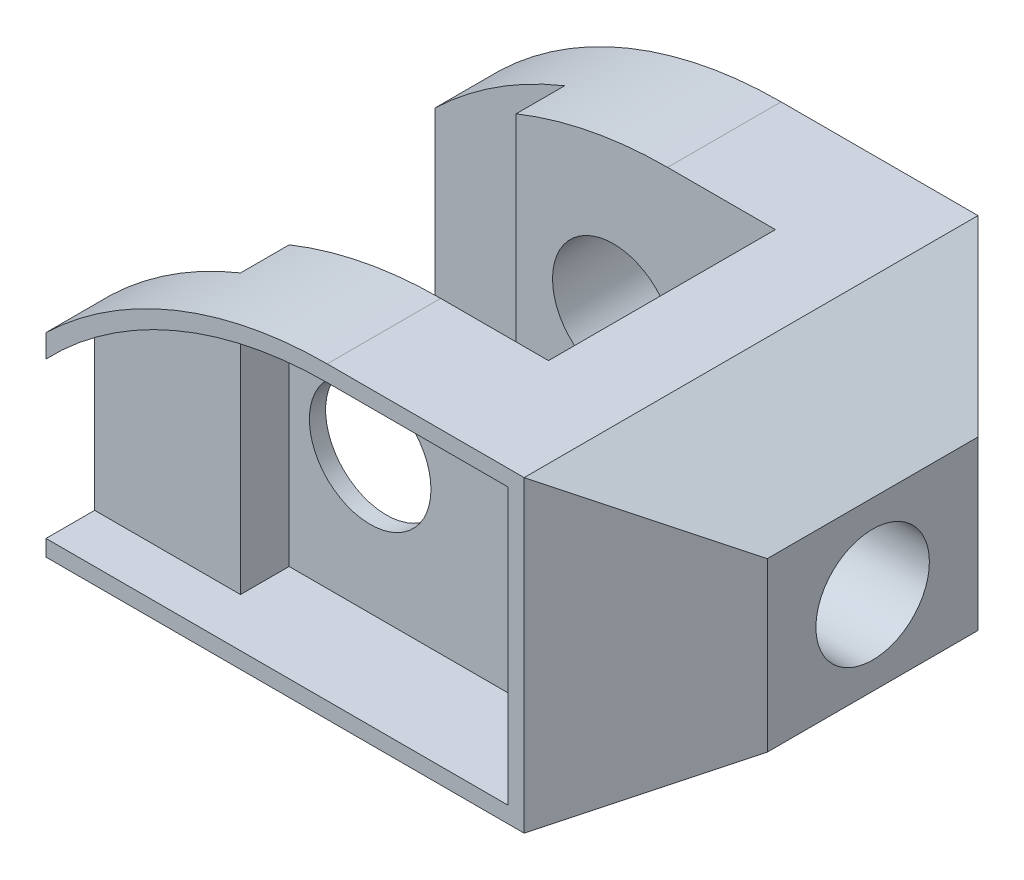
ISO-10303-21;
HEADER;
FILE_DESCRIPTION(('STEP AP214'),'2;1');
FILE_NAME('part.step','',(''),(''),'','','');
FILE_SCHEMA(('AUTOMOTIVE_DESIGN { 1 0 10303 214 1 1 1 1 }'));
ENDSEC;
DATA;
#1=APPLICATION_CONTEXT('core data for automotive mechanical design processes');
#2=APPLICATION_PROTOCOL_DEFINITION('international standard','automotive_design',2000,#1);
#3=PRODUCT_CONTEXT('',#1,'mechanical');
#4=PRODUCT('Part','Part','',(#3));
#5=PRODUCT_RELATED_PRODUCT_CATEGORY('part','',(#4));
#6=PRODUCT_DEFINITION_FORMATION('','',#4);
#7=PRODUCT_DEFINITION_CONTEXT('part definition',#1,'design');
#8=PRODUCT_DEFINITION('design','',#6,#7);
#9=PRODUCT_DEFINITION_SHAPE('','',#8);
#10=(LENGTH_UNIT() NAMED_UNIT(*) SI_UNIT(.MILLI.,.METRE.));
#11=(NAMED_UNIT(*) PLANE_ANGLE_UNIT() SI_UNIT($,.RADIAN.));
#12=(NAMED_UNIT(*) SI_UNIT($,.STERADIAN.) SOLID_ANGLE_UNIT());
#13=UNCERTAINTY_MEASURE_WITH_UNIT(LENGTH_MEASURE(1.E-05),#10,'distance_accuracy_value','');
#14=(GEOMETRIC_REPRESENTATION_CONTEXT(3) GLOBAL_UNCERTAINTY_ASSIGNED_CONTEXT((#13)) GLOBAL_UNIT_ASSIGNED_CONTEXT((#10,
#11,#12)) REPRESENTATION_CONTEXT('',''));
#15=CARTESIAN_POINT('',(0.,0.,0.));
#16=DIRECTION('',(0.,0.,1.));
#17=DIRECTION('',(1.,0.,0.));
#18=AXIS2_PLACEMENT_3D('',#15,#16,#17);
#19=CARTESIAN_POINT('',(0.,0.,56.));
#20=DIRECTION('',(0.,0.,-1.));
#21=DIRECTION('',(-1.,0.,0.));
#22=AXIS2_PLACEMENT_3D('',#19,#20,#21);
#23=CYLINDRICAL_SURFACE('',#22,7.5);
#24=CARTESIAN_POINT('',(0.,0.,42.));
#25=DIRECTION('',(0.,0.,1.));
#26=DIRECTION('',(1.,0.,0.));
#27=AXIS2_PLACEMENT_3D('',#24,#25,#26);
#28=CIRCLE('',#27,7.5);
#29=CARTESIAN_POINT('',(7.5,0.,42.));
#30=VERTEX_POINT('',#29);
#31=EDGE_CURVE('E302',#30,#30,#28,.T.);
#32=ORIENTED_EDGE('',*,*,#31,.F.);
#33=EDGE_LOOP('',(#32));
#34=FACE_BOUND('',#33,.T.);
#35=CARTESIAN_POINT('',(0.,0.,44.));
#36=DIRECTION('',(0.,0.,1.));
#37=DIRECTION('',(1.,0.,0.));
#38=AXIS2_PLACEMENT_3D('',#35,#36,#37);
#39=CIRCLE('',#38,7.5);
#40=CARTESIAN_POINT('',(7.5,0.,44.));
#41=VERTEX_POINT('',#40);
#42=EDGE_CURVE('E47',#41,#41,#39,.T.);
#43=ORIENTED_EDGE('',*,*,#42,.T.);
#44=EDGE_LOOP('',(#43));
#45=FACE_BOUND('',#44,.T.);
#46=ADVANCED_FACE('F43',(#34,#45),#23,.F.);
#47=CARTESIAN_POINT('',(-28.,-19.,56.));
#48=DIRECTION('',(1.,0.,0.));
#49=DIRECTION('',(0.,0.,-1.));
#50=AXIS2_PLACEMENT_3D('',#47,#48,#49);
#51=PLANE('',#50);
#52=DIRECTION('',(0.,0.,-1.));
#53=VECTOR('',#52,1.);
#54=CARTESIAN_POINT('',(-28.,-19.,56.));
#55=LINE('',#54,#53);
#56=CARTESIAN_POINT('',(-28.,-19.,8.));
#57=VERTEX_POINT('',#56);
#58=CARTESIAN_POINT('',(-28.,-19.,0.));
#59=VERTEX_POINT('',#58);
#60=EDGE_CURVE('E363',#57,#59,#55,.T.);
#61=ORIENTED_EDGE('',*,*,#60,.F.);
#62=DIRECTION('',(0.,1.,0.));
#63=VECTOR('',#62,1.);
#64=CARTESIAN_POINT('',(-28.,-81.4819974072532,8.));
#65=LINE('',#64,#63);
#66=CARTESIAN_POINT('',(-28.,5.,8.));
#67=VERTEX_POINT('',#66);
#68=EDGE_CURVE('E280',#57,#67,#65,.T.);
#69=ORIENTED_EDGE('',*,*,#68,.T.);
#70=DIRECTION('',(0.,0.,-1.));
#71=VECTOR('',#70,1.);
#72=CARTESIAN_POINT('',(-28.,4.99999999999999,56.));
#73=LINE('',#72,#71);
#74=CARTESIAN_POINT('',(-28.,4.99999999999999,0.));
#75=VERTEX_POINT('',#74);
#76=EDGE_CURVE('E332',#67,#75,#73,.T.);
#77=ORIENTED_EDGE('',*,*,#76,.T.);
#78=DIRECTION('',(0.,-1.,0.));
#79=VECTOR('',#78,1.);
#80=CARTESIAN_POINT('',(-28.,-19.,0.));
#81=LINE('',#80,#79);
#82=EDGE_CURVE('E320',#75,#59,#81,.T.);
#83=ORIENTED_EDGE('',*,*,#82,.T.);
#84=EDGE_LOOP('',(#61,#69,#77,#83));
#85=FACE_BOUND('',#84,.T.);
#86=ADVANCED_FACE('F465',(#85),#51,.F.);
#87=CARTESIAN_POINT('',(6.69870314579494,-31.,56.));
#88=DIRECTION('',(0.,0.,-1.));
#89=DIRECTION('',(-1.,0.,0.));
#90=AXIS2_PLACEMENT_3D('',#87,#88,#89);
#91=CYLINDRICAL_SURFACE('',#90,50.);
#92=ORIENTED_EDGE('',*,*,#76,.F.);
#93=CARTESIAN_POINT('',(6.69870314579494,-31.,8.));
#94=DIRECTION('',(0.,0.,-1.));
#95=DIRECTION('',(-1.,0.,0.));
#96=AXIS2_PLACEMENT_3D('',#93,#94,#95);
#97=CIRCLE('',#96,50.);
#98=CARTESIAN_POINT('',(-12.,15.3719581284362,8.));
#99=VERTEX_POINT('',#98);
#100=EDGE_CURVE('E380',#67,#99,#97,.T.);
#101=ORIENTED_EDGE('',*,*,#100,.T.);
#102=DIRECTION('',(0.,0.,-1.));
#103=VECTOR('',#102,1.);
#104=CARTESIAN_POINT('',(-12.,15.3719581284362,56.));
#105=LINE('',#104,#103);
#106=CARTESIAN_POINT('',(-12.,15.3719581284362,14.));
#107=VERTEX_POINT('',#106);
#108=EDGE_CURVE('E377',#99,#107,#105,.F.);
#109=ORIENTED_EDGE('',*,*,#108,.T.);
#110=CARTESIAN_POINT('',(6.69870314579494,-31.,14.));
#111=DIRECTION('',(0.,0.,-1.));
#112=DIRECTION('',(-1.,0.,0.));
#113=AXIS2_PLACEMENT_3D('',#110,#111,#112);
#114=CIRCLE('',#113,50.);
#115=CARTESIAN_POINT('',(6.69870314579496,19.,14.));
#116=VERTEX_POINT('',#115);
#117=EDGE_CURVE('E308',#107,#116,#114,.T.);
#118=ORIENTED_EDGE('',*,*,#117,.T.);
#119=DIRECTION('',(0.,0.,-1.));
#120=VECTOR('',#119,1.);
#121=CARTESIAN_POINT('',(6.69870314579495,19.,56.));
#122=LINE('',#121,#120);
#123=CARTESIAN_POINT('',(6.69870314579495,19.,0.));
#124=VERTEX_POINT('',#123);
#125=EDGE_CURVE('E347',#116,#124,#122,.T.);
#126=ORIENTED_EDGE('',*,*,#125,.T.);
#127=CARTESIAN_POINT('',(6.69870314579494,-31.,0.));
#128=DIRECTION('',(0.,0.,1.));
#129=DIRECTION('',(1.,0.,0.));
#130=AXIS2_PLACEMENT_3D('',#127,#128,#129);
#131=CIRCLE('',#130,50.);
#132=EDGE_CURVE('E341',#124,#75,#131,.T.);
#133=ORIENTED_EDGE('',*,*,#132,.T.);
#134=EDGE_LOOP('',(#92,#101,#109,#118,#126,#133));
#135=FACE_BOUND('',#134,.T.);
#136=ADVANCED_FACE('F404',(#135),#91,.T.);
#137=CARTESIAN_POINT('',(0.,0.,14.));
#138=DIRECTION('',(0.,0.,-1.));
#139=DIRECTION('',(-1.,0.,0.));
#140=AXIS2_PLACEMENT_3D('',#137,#138,#139);
#141=CIRCLE('',#140,7.5);
#142=CARTESIAN_POINT('',(-7.5,0.,14.));
#143=VERTEX_POINT('',#142);
#144=EDGE_CURVE('E307',#143,#143,#141,.T.);
#145=ORIENTED_EDGE('',*,*,#144,.F.);
#146=EDGE_LOOP('',(#145));
#147=FACE_BOUND('',#146,.T.);
#148=CARTESIAN_POINT('',(0.,0.,0.));
#149=DIRECTION('',(0.,0.,1.));
#150=DIRECTION('',(1.,0.,0.));
#151=AXIS2_PLACEMENT_3D('',#148,#149,#150);
#152=CIRCLE('',#151,7.5);
#153=CARTESIAN_POINT('',(7.5,0.,0.));
#154=VERTEX_POINT('',#153);
#155=EDGE_CURVE('E317',#154,#154,#152,.T.);
#156=ORIENTED_EDGE('',*,*,#155,.F.);
#157=EDGE_LOOP('',(#156));
#158=FACE_BOUND('',#157,.T.);
#159=ADVANCED_FACE('F467',(#147,#158),#23,.F.);
#160=CARTESIAN_POINT('',(6.69870314579494,-31.,56.));
#161=DIRECTION('',(0.,0.,1.));
#162=DIRECTION('',(1.,0.,0.));
#163=AXIS2_PLACEMENT_3D('',#160,#161,#162);
#164=PLANE('',#163);
#165=CARTESIAN_POINT('',(6.69870314579495,-31.,56.));
#166=DIRECTION('',(0.,0.,1.));
#167=DIRECTION('',(1.,0.,0.));
#168=AXIS2_PLACEMENT_3D('',#165,#166,#167);
#169=CIRCLE('',#168,48.);
#170=CARTESIAN_POINT('',(6.69870314579495,17.,56.));
#171=VERTEX_POINT('',#170);
#172=CARTESIAN_POINT('',(-28.,2.16624790355399,56.));
#173=VERTEX_POINT('',#172);
#174=EDGE_CURVE('E227',#171,#173,#169,.T.);
#175=ORIENTED_EDGE('',*,*,#174,.F.);
#176=DIRECTION('',(-1.,0.,0.));
#177=VECTOR('',#176,1.);
#178=CARTESIAN_POINT('',(29.,17.,56.));
#179=LINE('',#178,#177);
#180=CARTESIAN_POINT('',(29.,17.,56.));
#181=VERTEX_POINT('',#180);
#182=EDGE_CURVE('E235',#181,#171,#179,.T.);
#183=ORIENTED_EDGE('',*,*,#182,.F.);
#184=DIRECTION('',(0.,1.,0.));
#185=VECTOR('',#184,1.);
#186=CARTESIAN_POINT('',(29.,-17.,56.));
#187=LINE('',#186,#185);
#188=CARTESIAN_POINT('',(29.,-17.,56.));
#189=VERTEX_POINT('',#188);
#190=EDGE_CURVE('E232',#189,#181,#187,.T.);
#191=ORIENTED_EDGE('',*,*,#190,.F.);
#192=DIRECTION('',(1.,0.,0.));
#193=VECTOR('',#192,1.);
#194=CARTESIAN_POINT('',(-28.,-17.,56.));
#195=LINE('',#194,#193);
#196=CARTESIAN_POINT('',(-28.,-17.,56.));
#197=VERTEX_POINT('',#196);
#198=EDGE_CURVE('E229',#197,#189,#195,.T.);
#199=ORIENTED_EDGE('',*,*,#198,.F.);
#200=DIRECTION('',(0.,-1.,0.));
#201=VECTOR('',#200,1.);
#202=CARTESIAN_POINT('',(-28.,-19.,56.));
#203=LINE('',#202,#201);
#204=CARTESIAN_POINT('',(-28.,-19.,56.));
#205=VERTEX_POINT('',#204);
#206=EDGE_CURVE('E325',#197,#205,#203,.T.);
#207=ORIENTED_EDGE('',*,*,#206,.T.);
#208=DIRECTION('',(1.,0.,0.));
#209=VECTOR('',#208,1.);
#210=CARTESIAN_POINT('',(-28.,-19.,56.));
#211=LINE('',#210,#209);
#212=CARTESIAN_POINT('',(31.,-19.,56.));
#213=VERTEX_POINT('',#212);
#214=EDGE_CURVE('E324',#205,#213,#211,.T.);
#215=ORIENTED_EDGE('',*,*,#214,.T.);
#216=DIRECTION('',(0.,1.,0.));
#217=VECTOR('',#216,1.);
#218=CARTESIAN_POINT('',(31.,-81.4819974072532,56.));
#219=LINE('',#218,#217);
#220=CARTESIAN_POINT('',(31.,19.,56.));
#221=VERTEX_POINT('',#220);
#222=EDGE_CURVE('E254',#213,#221,#219,.T.);
#223=ORIENTED_EDGE('',*,*,#222,.T.);
#224=DIRECTION('',(-1.,0.,0.));
#225=VECTOR('',#224,1.);
#226=CARTESIAN_POINT('',(6.69870314579495,19.,56.));
#227=LINE('',#226,#225);
#228=CARTESIAN_POINT('',(6.69870314579495,19.,56.));
#229=VERTEX_POINT('',#228);
#230=EDGE_CURVE('E328',#221,#229,#227,.T.);
#231=ORIENTED_EDGE('',*,*,#230,.T.);
#232=CARTESIAN_POINT('',(6.69870314579494,-31.,56.));
#233=DIRECTION('',(0.,0.,1.));
#234=DIRECTION('',(1.,0.,0.));
#235=AXIS2_PLACEMENT_3D('',#232,#233,#234);
#236=CIRCLE('',#235,50.);
#237=CARTESIAN_POINT('',(-28.,4.99999999999999,56.));
#238=VERTEX_POINT('',#237);
#239=EDGE_CURVE('E330',#229,#238,#236,.T.);
#240=ORIENTED_EDGE('',*,*,#239,.T.);
#241=EDGE_CURVE('E321',#238,#173,#203,.T.);
#242=ORIENTED_EDGE('',*,*,#241,.T.);
#243=EDGE_LOOP('',(#175,#183,#191,#199,#207,#215,#223,#231,#240,#242));
#244=FACE_BOUND('',#243,.T.);
#245=ADVANCED_FACE('F441',(#244),#164,.T.);
#246=CARTESIAN_POINT('',(6.69870314579494,-31.,0.));
#247=DIRECTION('',(0.,0.,1.));
#248=DIRECTION('',(1.,0.,0.));
#249=AXIS2_PLACEMENT_3D('',#246,#247,#248);
#250=PLANE('',#249);
#251=DIRECTION('',(-1.,0.,0.));
#252=VECTOR('',#251,1.);
#253=CARTESIAN_POINT('',(6.69870314579495,19.,0.));
#254=LINE('',#253,#252);
#255=CARTESIAN_POINT('',(31.,19.,0.));
#256=VERTEX_POINT('',#255);
#257=EDGE_CURVE('E338',#256,#124,#254,.T.);
#258=ORIENTED_EDGE('',*,*,#257,.F.);
#259=DIRECTION('',(0.,1.,0.));
#260=VECTOR('',#259,1.);
#261=CARTESIAN_POINT('',(31.,-81.4819974072532,0.));
#262=LINE('',#261,#260);
#263=CARTESIAN_POINT('',(31.,-19.,0.));
#264=VERTEX_POINT('',#263);
#265=EDGE_CURVE('E253',#264,#256,#262,.T.);
#266=ORIENTED_EDGE('',*,*,#265,.F.);
#267=DIRECTION('',(1.,0.,0.));
#268=VECTOR('',#267,1.);
#269=CARTESIAN_POINT('',(-28.,-19.,0.));
#270=LINE('',#269,#268);
#271=EDGE_CURVE('E335',#59,#264,#270,.T.);
#272=ORIENTED_EDGE('',*,*,#271,.F.);
#273=ORIENTED_EDGE('',*,*,#82,.F.);
#274=ORIENTED_EDGE('',*,*,#132,.F.);
#275=EDGE_LOOP('',(#258,#266,#272,#273,#274));
#276=FACE_BOUND('',#275,.T.);
#277=ORIENTED_EDGE('',*,*,#155,.T.);
#278=EDGE_LOOP('',(#277));
#279=FACE_BOUND('',#278,.T.);
#280=ADVANCED_FACE('F398',(#276,#279),#250,.F.);
#281=DIRECTION('',(0.,1.,0.));
#282=VECTOR('',#281,1.);
#283=CARTESIAN_POINT('',(-28.,2.16624790355399,50.));
#284=LINE('',#283,#282);
#285=CARTESIAN_POINT('',(-28.,-17.,50.));
#286=VERTEX_POINT('',#285);
#287=CARTESIAN_POINT('',(-28.,2.166247903554,50.));
#288=VERTEX_POINT('',#287);
#289=EDGE_CURVE('E219',#286,#288,#284,.T.);
#290=ORIENTED_EDGE('',*,*,#289,.T.);
#291=DIRECTION('',(0.,0.,1.));
#292=VECTOR('',#291,1.);
#293=CARTESIAN_POINT('',(-28.,2.16624790355399,-18.3701740241805));
#294=LINE('',#293,#292);
#295=EDGE_CURVE('E59',#288,#173,#294,.T.);
#296=ORIENTED_EDGE('',*,*,#295,.T.);
#297=ORIENTED_EDGE('',*,*,#241,.F.);
#298=CARTESIAN_POINT('',(-28.,4.99999999999999,48.));
#299=VERTEX_POINT('',#298);
#300=EDGE_CURVE('E344',#238,#299,#73,.T.);
#301=ORIENTED_EDGE('',*,*,#300,.T.);
#302=DIRECTION('',(0.,1.,0.));
#303=VECTOR('',#302,1.);
#304=CARTESIAN_POINT('',(-28.,-81.4819974072532,48.));
#305=LINE('',#304,#303);
#306=CARTESIAN_POINT('',(-28.,-19.,48.));
#307=VERTEX_POINT('',#306);
#308=EDGE_CURVE('E260',#307,#299,#305,.T.);
#309=ORIENTED_EDGE('',*,*,#308,.F.);
#310=EDGE_CURVE('E364',#205,#307,#55,.T.);
#311=ORIENTED_EDGE('',*,*,#310,.F.);
#312=ORIENTED_EDGE('',*,*,#206,.F.);
#313=DIRECTION('',(0.,0.,1.));
#314=VECTOR('',#313,1.);
#315=CARTESIAN_POINT('',(-28.,-17.,-18.3701740241805));
#316=LINE('',#315,#314);
#317=EDGE_CURVE('E243',#286,#197,#316,.T.);
#318=ORIENTED_EDGE('',*,*,#317,.F.);
#319=EDGE_LOOP('',(#290,#296,#297,#301,#309,#311,#312,#318));
#320=FACE_BOUND('',#319,.T.);
#321=ADVANCED_FACE('F45',(#320),#51,.F.);
#322=CARTESIAN_POINT('',(-28.,-19.,56.));
#323=DIRECTION('',(0.,1.,0.));
#324=DIRECTION('',(0.,0.,1.));
#325=AXIS2_PLACEMENT_3D('',#322,#323,#324);
#326=PLANE('',#325);
#327=DIRECTION('',(0.,0.,1.));
#328=VECTOR('',#327,1.);
#329=CARTESIAN_POINT('',(-12.,-19.,8.));
#330=LINE('',#329,#328);
#331=CARTESIAN_POINT('',(-12.,-19.,8.));
#332=VERTEX_POINT('',#331);
#333=CARTESIAN_POINT('',(-12.,-19.,14.));
#334=VERTEX_POINT('',#333);
#335=EDGE_CURVE('E290',#332,#334,#330,.T.);
#336=ORIENTED_EDGE('',*,*,#335,.F.);
#337=DIRECTION('',(1.,0.,0.));
#338=VECTOR('',#337,1.);
#339=CARTESIAN_POINT('',(-28.,-19.,8.));
#340=LINE('',#339,#338);
#341=EDGE_CURVE('E259',#57,#332,#340,.T.);
#342=ORIENTED_EDGE('',*,*,#341,.F.);
#343=ORIENTED_EDGE('',*,*,#60,.T.);
#344=ORIENTED_EDGE('',*,*,#271,.T.);
#345=DIRECTION('',(0.,0.,-1.));
#346=VECTOR('',#345,1.);
#347=CARTESIAN_POINT('',(31.,-19.,56.));
#348=LINE('',#347,#346);
#349=EDGE_CURVE('E360',#213,#264,#348,.T.);
#350=ORIENTED_EDGE('',*,*,#349,.F.);
#351=ORIENTED_EDGE('',*,*,#214,.F.);
#352=ORIENTED_EDGE('',*,*,#310,.T.);
#353=DIRECTION('',(-1.,0.,0.));
#354=VECTOR('',#353,1.);
#355=CARTESIAN_POINT('',(-28.,-19.,48.));
#356=LINE('',#355,#354);
#357=CARTESIAN_POINT('',(-12.,-19.,48.));
#358=VERTEX_POINT('',#357);
#359=EDGE_CURVE('E251',#358,#307,#356,.T.);
#360=ORIENTED_EDGE('',*,*,#359,.F.);
#361=DIRECTION('',(0.,0.,1.));
#362=VECTOR('',#361,1.);
#363=CARTESIAN_POINT('',(-12.,-19.,48.));
#364=LINE('',#363,#362);
#365=CARTESIAN_POINT('',(-12.,-19.,42.));
#366=VERTEX_POINT('',#365);
#367=EDGE_CURVE('E283',#366,#358,#364,.T.);
#368=ORIENTED_EDGE('',*,*,#367,.F.);
#369=DIRECTION('',(-1.,0.,0.));
#370=VECTOR('',#369,1.);
#371=CARTESIAN_POINT('',(-12.,-19.,42.));
#372=LINE('',#371,#370);
#373=CARTESIAN_POINT('',(20.,-19.,42.));
#374=VERTEX_POINT('',#373);
#375=EDGE_CURVE('E296',#374,#366,#372,.T.);
#376=ORIENTED_EDGE('',*,*,#375,.F.);
#377=DIRECTION('',(0.,0.,1.));
#378=VECTOR('',#377,1.);
#379=CARTESIAN_POINT('',(20.,-19.,14.));
#380=LINE('',#379,#378);
#381=CARTESIAN_POINT('',(20.,-19.,14.));
#382=VERTEX_POINT('',#381);
#383=EDGE_CURVE('E294',#382,#374,#380,.T.);
#384=ORIENTED_EDGE('',*,*,#383,.F.);
#385=DIRECTION('',(1.,0.,0.));
#386=VECTOR('',#385,1.);
#387=CARTESIAN_POINT('',(-12.,-19.,14.));
#388=LINE('',#387,#386);
#389=EDGE_CURVE('E292',#334,#382,#388,.T.);
#390=ORIENTED_EDGE('',*,*,#389,.F.);
#391=EDGE_LOOP('',(#336,#342,#343,#344,#350,#351,#352,#360,#368,#376,#384,#390));
#392=FACE_BOUND('',#391,.T.);
#393=ADVANCED_FACE('F424',(#392),#326,.F.);
#394=CARTESIAN_POINT('',(31.,-19.,56.));
#395=DIRECTION('',(-0.500000000000001,0.866025403784438,0.));
#396=DIRECTION('',(-0.866025403784438,-0.500000000000001,0.));
#397=AXIS2_PLACEMENT_3D('',#394,#395,#396);
#398=PLANE('',#397);
#399=DIRECTION('',(0.,0.,-1.));
#400=VECTOR('',#399,1.);
#401=CARTESIAN_POINT('',(46.,-10.3397459621556,56.));
#402=LINE('',#401,#400);
#403=CARTESIAN_POINT('',(46.,-10.3397459621556,41.0000000000002));
#404=VERTEX_POINT('',#403);
#405=CARTESIAN_POINT('',(46.,-10.3397459621556,14.9999999999998));
#406=VERTEX_POINT('',#405);
#407=EDGE_CURVE('E357',#404,#406,#402,.T.);
#408=ORIENTED_EDGE('',*,*,#407,.F.);
#409=DIRECTION('',(-0.65465367070798,-0.37796447300923,0.654653670707973));
#410=VECTOR('',#409,1.);
#411=CARTESIAN_POINT('',(31.,-19.,56.));
#412=LINE('',#411,#410);
#413=EDGE_CURVE('E314',#404,#213,#412,.T.);
#414=ORIENTED_EDGE('',*,*,#413,.T.);
#415=ORIENTED_EDGE('',*,*,#349,.T.);
#416=DIRECTION('',(0.65465367070798,0.37796447300923,0.654653670707973));
#417=VECTOR('',#416,1.);
#418=CARTESIAN_POINT('',(54.9999999999999,-5.14359353944897,23.9999999999997));
#419=LINE('',#418,#417);
#420=EDGE_CURVE('E311',#264,#406,#419,.T.);
#421=ORIENTED_EDGE('',*,*,#420,.T.);
#422=EDGE_LOOP('',(#408,#414,#415,#421));
#423=FACE_BOUND('',#422,.T.);
#424=ADVANCED_FACE('F448',(#423),#398,.F.);
#425=CARTESIAN_POINT('',(46.,10.3397459621556,56.));
#426=DIRECTION('',(-1.,0.,0.));
#427=DIRECTION('',(0.,0.,1.));
#428=AXIS2_PLACEMENT_3D('',#425,#426,#427);
#429=PLANE('',#428);
#430=CARTESIAN_POINT('',(46.,0.,28.));
#431=DIRECTION('',(1.,0.,0.));
#432=DIRECTION('',(0.,0.,-1.));
#433=AXIS2_PLACEMENT_3D('',#430,#431,#432);
#434=CIRCLE('',#433,7.);
#435=CARTESIAN_POINT('',(46.,0.,21.));
#436=VERTEX_POINT('',#435);
#437=EDGE_CURVE('E221',#436,#436,#434,.T.);
#438=ORIENTED_EDGE('',*,*,#437,.F.);
#439=EDGE_LOOP('',(#438));
#440=FACE_BOUND('',#439,.T.);
#441=DIRECTION('',(0.,0.,-1.));
#442=VECTOR('',#441,1.);
#443=CARTESIAN_POINT('',(46.,10.3397459621556,56.));
#444=LINE('',#443,#442);
#445=CARTESIAN_POINT('',(46.,10.3397459621556,41.0000000000002));
#446=VERTEX_POINT('',#445);
#447=CARTESIAN_POINT('',(46.,10.3397459621556,14.9999999999998));
#448=VERTEX_POINT('',#447);
#449=EDGE_CURVE('E354',#446,#448,#444,.T.);
#450=ORIENTED_EDGE('',*,*,#449,.F.);
#451=DIRECTION('',(0.,1.,0.));
#452=VECTOR('',#451,1.);
#453=CARTESIAN_POINT('',(46.,-81.4819974072532,41.0000000000002));
#454=LINE('',#453,#452);
#455=EDGE_CURVE('E67',#404,#446,#454,.T.);
#456=ORIENTED_EDGE('',*,*,#455,.F.);
#457=ORIENTED_EDGE('',*,*,#407,.T.);
#458=DIRECTION('',(0.,1.,0.));
#459=VECTOR('',#458,1.);
#460=CARTESIAN_POINT('',(46.,-81.4819974072532,14.9999999999998));
#461=LINE('',#460,#459);
#462=EDGE_CURVE('E299',#406,#448,#461,.T.);
#463=ORIENTED_EDGE('',*,*,#462,.T.);
#464=EDGE_LOOP('',(#450,#456,#457,#463));
#465=FACE_BOUND('',#464,.T.);
#466=ADVANCED_FACE('F450',(#440,#465),#429,.F.);
#467=CARTESIAN_POINT('',(31.,19.,56.));
#468=DIRECTION('',(-0.500000000000001,-0.866025403784438,0.));
#469=DIRECTION('',(0.866025403784438,-0.500000000000001,0.));
#470=AXIS2_PLACEMENT_3D('',#467,#468,#469);
#471=PLANE('',#470);
#472=DIRECTION('',(0.,0.,-1.));
#473=VECTOR('',#472,1.);
#474=CARTESIAN_POINT('',(31.,19.,56.));
#475=LINE('',#474,#473);
#476=EDGE_CURVE('E351',#221,#256,#475,.T.);
#477=ORIENTED_EDGE('',*,*,#476,.F.);
#478=DIRECTION('',(0.65465367070798,-0.37796447300923,-0.654653670707973));
#479=VECTOR('',#478,1.);
#480=CARTESIAN_POINT('',(31.,19.,56.));
#481=LINE('',#480,#479);
#482=EDGE_CURVE('E12',#221,#446,#481,.T.);
#483=ORIENTED_EDGE('',*,*,#482,.T.);
#484=ORIENTED_EDGE('',*,*,#449,.T.);
#485=DIRECTION('',(-0.65465367070798,0.37796447300923,-0.654653670707973));
#486=VECTOR('',#485,1.);
#487=CARTESIAN_POINT('',(54.9999999999999,5.14359353944898,23.9999999999997));
#488=LINE('',#487,#486);
#489=EDGE_CURVE('E52',#448,#256,#488,.T.);
#490=ORIENTED_EDGE('',*,*,#489,.T.);
#491=EDGE_LOOP('',(#477,#483,#484,#490));
#492=FACE_BOUND('',#491,.T.);
#493=ADVANCED_FACE('F386',(#492),#471,.F.);
#494=CARTESIAN_POINT('',(6.69870314579495,19.,56.));
#495=DIRECTION('',(0.,-1.,0.));
#496=DIRECTION('',(1.,0.,0.));
#497=AXIS2_PLACEMENT_3D('',#494,#495,#496);
#498=PLANE('',#497);
#499=ORIENTED_EDGE('',*,*,#125,.F.);
#500=DIRECTION('',(-1.,0.,0.));
#501=VECTOR('',#500,1.);
#502=CARTESIAN_POINT('',(-12.,19.,14.));
#503=LINE('',#502,#501);
#504=CARTESIAN_POINT('',(20.,19.,14.));
#505=VERTEX_POINT('',#504);
#506=EDGE_CURVE('E262',#505,#116,#503,.T.);
#507=ORIENTED_EDGE('',*,*,#506,.F.);
#508=DIRECTION('',(0.,0.,-1.));
#509=VECTOR('',#508,1.);
#510=CARTESIAN_POINT('',(20.,19.,14.));
#511=LINE('',#510,#509);
#512=CARTESIAN_POINT('',(20.,19.,42.));
#513=VERTEX_POINT('',#512);
#514=EDGE_CURVE('E285',#513,#505,#511,.T.);
#515=ORIENTED_EDGE('',*,*,#514,.F.);
#516=DIRECTION('',(1.,0.,0.));
#517=VECTOR('',#516,1.);
#518=CARTESIAN_POINT('',(-12.,19.,42.));
#519=LINE('',#518,#517);
#520=CARTESIAN_POINT('',(6.69870314579496,19.,42.));
#521=VERTEX_POINT('',#520);
#522=EDGE_CURVE('E257',#521,#513,#519,.T.);
#523=ORIENTED_EDGE('',*,*,#522,.F.);
#524=EDGE_CURVE('E348',#229,#521,#122,.T.);
#525=ORIENTED_EDGE('',*,*,#524,.F.);
#526=ORIENTED_EDGE('',*,*,#230,.F.);
#527=ORIENTED_EDGE('',*,*,#476,.T.);
#528=ORIENTED_EDGE('',*,*,#257,.T.);
#529=EDGE_LOOP('',(#499,#507,#515,#523,#525,#526,#527,#528));
#530=FACE_BOUND('',#529,.T.);
#531=ADVANCED_FACE('F393',(#530),#498,.F.);
#532=ORIENTED_EDGE('',*,*,#524,.T.);
#533=CARTESIAN_POINT('',(6.69870314579494,-31.,42.));
#534=DIRECTION('',(0.,0.,1.));
#535=DIRECTION('',(1.,0.,0.));
#536=AXIS2_PLACEMENT_3D('',#533,#534,#535);
#537=CIRCLE('',#536,50.);
#538=CARTESIAN_POINT('',(-12.,15.3719581284362,42.));
#539=VERTEX_POINT('',#538);
#540=EDGE_CURVE('E304',#521,#539,#537,.T.);
#541=ORIENTED_EDGE('',*,*,#540,.T.);
#542=DIRECTION('',(0.,0.,-1.));
#543=VECTOR('',#542,1.);
#544=CARTESIAN_POINT('',(-12.,15.3719581284362,56.));
#545=LINE('',#544,#543);
#546=CARTESIAN_POINT('',(-12.,15.3719581284362,48.));
#547=VERTEX_POINT('',#546);
#548=EDGE_CURVE('E374',#539,#547,#545,.F.);
#549=ORIENTED_EDGE('',*,*,#548,.T.);
#550=CARTESIAN_POINT('',(6.69870314579494,-31.,48.));
#551=DIRECTION('',(0.,0.,1.));
#552=DIRECTION('',(1.,0.,0.));
#553=AXIS2_PLACEMENT_3D('',#550,#551,#552);
#554=CIRCLE('',#553,50.);
#555=EDGE_CURVE('E367',#547,#299,#554,.T.);
#556=ORIENTED_EDGE('',*,*,#555,.T.);
#557=ORIENTED_EDGE('',*,*,#300,.F.);
#558=ORIENTED_EDGE('',*,*,#239,.F.);
#559=EDGE_LOOP('',(#532,#541,#549,#556,#557,#558));
#560=FACE_BOUND('',#559,.T.);
#561=ADVANCED_FACE('F434',(#560),#91,.T.);
#562=CARTESIAN_POINT('',(-28.,-81.4819974072532,8.));
#563=DIRECTION('',(0.,0.,-1.));
#564=DIRECTION('',(-1.,0.,0.));
#565=AXIS2_PLACEMENT_3D('',#562,#563,#564);
#566=PLANE('',#565);
#567=ORIENTED_EDGE('',*,*,#68,.F.);
#568=ORIENTED_EDGE('',*,*,#341,.T.);
#569=DIRECTION('',(0.,1.,0.));
#570=VECTOR('',#569,1.);
#571=CARTESIAN_POINT('',(-12.,-81.4819974072532,8.));
#572=LINE('',#571,#570);
#573=EDGE_CURVE('E277',#332,#99,#572,.T.);
#574=ORIENTED_EDGE('',*,*,#573,.T.);
#575=ORIENTED_EDGE('',*,*,#100,.F.);
#576=EDGE_LOOP('',(#567,#568,#574,#575));
#577=FACE_BOUND('',#576,.T.);
#578=ADVANCED_FACE('F492',(#577),#566,.F.);
#579=CARTESIAN_POINT('',(-12.,-81.4819974072532,8.));
#580=DIRECTION('',(1.,0.,0.));
#581=DIRECTION('',(0.,1.,0.));
#582=AXIS2_PLACEMENT_3D('',#579,#580,#581);
#583=PLANE('',#582);
#584=ORIENTED_EDGE('',*,*,#573,.F.);
#585=ORIENTED_EDGE('',*,*,#335,.T.);
#586=DIRECTION('',(0.,1.,0.));
#587=VECTOR('',#586,1.);
#588=CARTESIAN_POINT('',(-12.,-81.4819974072532,14.));
#589=LINE('',#588,#587);
#590=EDGE_CURVE('E274',#334,#107,#589,.T.);
#591=ORIENTED_EDGE('',*,*,#590,.T.);
#592=ORIENTED_EDGE('',*,*,#108,.F.);
#593=EDGE_LOOP('',(#584,#585,#591,#592));
#594=FACE_BOUND('',#593,.T.);
#595=ADVANCED_FACE('F534',(#594),#583,.F.);
#596=CARTESIAN_POINT('',(-12.,-81.4819974072532,48.));
#597=DIRECTION('',(1.,0.,0.));
#598=DIRECTION('',(0.,1.,0.));
#599=AXIS2_PLACEMENT_3D('',#596,#597,#598);
#600=PLANE('',#599);
#601=DIRECTION('',(0.,1.,0.));
#602=VECTOR('',#601,1.);
#603=CARTESIAN_POINT('',(-12.,-81.4819974072532,42.));
#604=LINE('',#603,#602);
#605=EDGE_CURVE('E266',#366,#539,#604,.T.);
#606=ORIENTED_EDGE('',*,*,#605,.F.);
#607=ORIENTED_EDGE('',*,*,#367,.T.);
#608=DIRECTION('',(0.,1.,0.));
#609=VECTOR('',#608,1.);
#610=CARTESIAN_POINT('',(-12.,-81.4819974072532,48.));
#611=LINE('',#610,#609);
#612=EDGE_CURVE('E263',#358,#547,#611,.T.);
#613=ORIENTED_EDGE('',*,*,#612,.T.);
#614=ORIENTED_EDGE('',*,*,#548,.F.);
#615=EDGE_LOOP('',(#606,#607,#613,#614));
#616=FACE_BOUND('',#615,.T.);
#617=ADVANCED_FACE('F428',(#616),#600,.F.);
#618=CARTESIAN_POINT('',(-28.,-81.4819974072532,48.));
#619=DIRECTION('',(0.,0.,1.));
#620=DIRECTION('',(1.,0.,0.));
#621=AXIS2_PLACEMENT_3D('',#618,#619,#620);
#622=PLANE('',#621);
#623=ORIENTED_EDGE('',*,*,#612,.F.);
#624=ORIENTED_EDGE('',*,*,#359,.T.);
#625=ORIENTED_EDGE('',*,*,#308,.T.);
#626=ORIENTED_EDGE('',*,*,#555,.F.);
#627=EDGE_LOOP('',(#623,#624,#625,#626));
#628=FACE_BOUND('',#627,.T.);
#629=ADVANCED_FACE('F430',(#628),#622,.F.);
#630=CARTESIAN_POINT('',(-12.,-81.4819974072532,14.));
#631=DIRECTION('',(0.,0.,-1.));
#632=DIRECTION('',(-1.,0.,0.));
#633=AXIS2_PLACEMENT_3D('',#630,#631,#632);
#634=PLANE('',#633);
#635=ORIENTED_EDGE('',*,*,#144,.T.);
#636=EDGE_LOOP('',(#635));
#637=FACE_BOUND('',#636,.T.);
#638=ORIENTED_EDGE('',*,*,#590,.F.);
#639=ORIENTED_EDGE('',*,*,#389,.T.);
#640=DIRECTION('',(0.,1.,0.));
#641=VECTOR('',#640,1.);
#642=CARTESIAN_POINT('',(20.,-81.4819974072532,14.));
#643=LINE('',#642,#641);
#644=EDGE_CURVE('E272',#382,#505,#643,.T.);
#645=ORIENTED_EDGE('',*,*,#644,.T.);
#646=ORIENTED_EDGE('',*,*,#506,.T.);
#647=ORIENTED_EDGE('',*,*,#117,.F.);
#648=EDGE_LOOP('',(#638,#639,#645,#646,#647));
#649=FACE_BOUND('',#648,.T.);
#650=ADVANCED_FACE('F410',(#637,#649),#634,.F.);
#651=CARTESIAN_POINT('',(-12.,-81.4819974072532,42.));
#652=DIRECTION('',(0.,0.,1.));
#653=DIRECTION('',(1.,0.,0.));
#654=AXIS2_PLACEMENT_3D('',#651,#652,#653);
#655=PLANE('',#654);
#656=ORIENTED_EDGE('',*,*,#31,.T.);
#657=EDGE_LOOP('',(#656));
#658=FACE_BOUND('',#657,.T.);
#659=ORIENTED_EDGE('',*,*,#522,.T.);
#660=DIRECTION('',(0.,1.,0.));
#661=VECTOR('',#660,1.);
#662=CARTESIAN_POINT('',(20.,-81.4819974072532,42.));
#663=LINE('',#662,#661);
#664=EDGE_CURVE('E269',#374,#513,#663,.T.);
#665=ORIENTED_EDGE('',*,*,#664,.F.);
#666=ORIENTED_EDGE('',*,*,#375,.T.);
#667=ORIENTED_EDGE('',*,*,#605,.T.);
#668=ORIENTED_EDGE('',*,*,#540,.F.);
#669=EDGE_LOOP('',(#659,#665,#666,#667,#668));
#670=FACE_BOUND('',#669,.T.);
#671=ADVANCED_FACE('F419',(#658,#670),#655,.F.);
#672=CARTESIAN_POINT('',(20.,-81.4819974072532,14.));
#673=DIRECTION('',(1.,0.,0.));
#674=DIRECTION('',(0.,1.,0.));
#675=AXIS2_PLACEMENT_3D('',#672,#673,#674);
#676=PLANE('',#675);
#677=CARTESIAN_POINT('',(20.,0.,28.));
#678=DIRECTION('',(1.,0.,0.));
#679=DIRECTION('',(0.,1.,0.));
#680=AXIS2_PLACEMENT_3D('',#677,#678,#679);
#681=CIRCLE('',#680,7.);
#682=CARTESIAN_POINT('',(20.,7.,28.));
#683=VERTEX_POINT('',#682);
#684=EDGE_CURVE('E248',#683,#683,#681,.F.);
#685=ORIENTED_EDGE('',*,*,#684,.F.);
#686=EDGE_LOOP('',(#685));
#687=FACE_BOUND('',#686,.T.);
#688=ORIENTED_EDGE('',*,*,#383,.T.);
#689=ORIENTED_EDGE('',*,*,#664,.T.);
#690=ORIENTED_EDGE('',*,*,#514,.T.);
#691=ORIENTED_EDGE('',*,*,#644,.F.);
#692=EDGE_LOOP('',(#688,#689,#690,#691));
#693=FACE_BOUND('',#692,.T.);
#694=ADVANCED_FACE('F415',(#687,#693),#676,.F.);
#695=CARTESIAN_POINT('',(31.,-81.4819974072532,0.));
#696=DIRECTION('',(-0.707106781186544,0.,0.707106781186551));
#697=DIRECTION('',(0.707106781186551,0.,0.707106781186544));
#698=AXIS2_PLACEMENT_3D('',#695,#696,#697);
#699=PLANE('',#698);
#700=ORIENTED_EDGE('',*,*,#265,.T.);
#701=ORIENTED_EDGE('',*,*,#489,.F.);
#702=ORIENTED_EDGE('',*,*,#462,.F.);
#703=ORIENTED_EDGE('',*,*,#420,.F.);
#704=EDGE_LOOP('',(#700,#701,#702,#703));
#705=FACE_BOUND('',#704,.T.);
#706=ADVANCED_FACE('F451',(#705),#699,.F.);
#707=CARTESIAN_POINT('',(31.,-81.4819974072532,56.));
#708=DIRECTION('',(-0.707106781186544,0.,-0.707106781186551));
#709=DIRECTION('',(-0.707106781186551,0.,0.707106781186544));
#710=AXIS2_PLACEMENT_3D('',#707,#708,#709);
#711=PLANE('',#710);
#712=ORIENTED_EDGE('',*,*,#455,.T.);
#713=ORIENTED_EDGE('',*,*,#482,.F.);
#714=ORIENTED_EDGE('',*,*,#222,.F.);
#715=ORIENTED_EDGE('',*,*,#413,.F.);
#716=EDGE_LOOP('',(#712,#713,#714,#715));
#717=FACE_BOUND('',#716,.T.);
#718=ADVANCED_FACE('F445',(#717),#711,.F.);
#719=CARTESIAN_POINT('',(0.201010126776667,0.,28.));
#720=DIRECTION('',(1.,0.,0.));
#721=DIRECTION('',(0.,0.,-1.));
#722=AXIS2_PLACEMENT_3D('',#719,#720,#721);
#723=CYLINDRICAL_SURFACE('',#722,7.);
#724=ORIENTED_EDGE('',*,*,#684,.T.);
#725=EDGE_LOOP('',(#724));
#726=FACE_BOUND('',#725,.T.);
#727=ORIENTED_EDGE('',*,*,#437,.T.);
#728=EDGE_LOOP('',(#727));
#729=FACE_BOUND('',#728,.T.);
#730=ADVANCED_FACE('F458',(#726,#729),#723,.F.);
#731=CARTESIAN_POINT('',(6.69870314579495,-31.,-18.3701740241805));
#732=DIRECTION('',(0.,0.,1.));
#733=DIRECTION('',(1.,0.,0.));
#734=AXIS2_PLACEMENT_3D('',#731,#732,#733);
#735=CYLINDRICAL_SURFACE('',#734,48.);
#736=CARTESIAN_POINT('',(6.69870314579495,-31.,50.));
#737=DIRECTION('',(0.,0.,1.));
#738=DIRECTION('',(1.,0.,0.));
#739=AXIS2_PLACEMENT_3D('',#736,#737,#738);
#740=CIRCLE('',#739,48.);
#741=CARTESIAN_POINT('',(-10.,14.0017034482987,50.));
#742=VERTEX_POINT('',#741);
#743=EDGE_CURVE('E214',#288,#742,#740,.F.);
#744=ORIENTED_EDGE('',*,*,#743,.T.);
#745=DIRECTION('',(0.,0.,1.));
#746=VECTOR('',#745,1.);
#747=CARTESIAN_POINT('',(-10.,14.0017034482987,-9.73973328110612));
#748=LINE('',#747,#746);
#749=CARTESIAN_POINT('',(-10.,14.0017034482987,44.));
#750=VERTEX_POINT('',#749);
#751=EDGE_CURVE('E199',#750,#742,#748,.T.);
#752=ORIENTED_EDGE('',*,*,#751,.F.);
#753=CARTESIAN_POINT('',(6.69870314579495,-31.,44.));
#754=DIRECTION('',(0.,0.,1.));
#755=DIRECTION('',(1.,0.,0.));
#756=AXIS2_PLACEMENT_3D('',#753,#754,#755);
#757=CIRCLE('',#756,48.);
#758=CARTESIAN_POINT('',(6.69870314579495,17.,44.));
#759=VERTEX_POINT('',#758);
#760=EDGE_CURVE('E797',#750,#759,#757,.F.);
#761=ORIENTED_EDGE('',*,*,#760,.T.);
#762=DIRECTION('',(0.,0.,1.));
#763=VECTOR('',#762,1.);
#764=CARTESIAN_POINT('',(6.69870314579495,17.,-18.3701740241805));
#765=LINE('',#764,#763);
#766=EDGE_CURVE('E223',#759,#171,#765,.T.);
#767=ORIENTED_EDGE('',*,*,#766,.T.);
#768=ORIENTED_EDGE('',*,*,#174,.T.);
#769=ORIENTED_EDGE('',*,*,#295,.F.);
#770=EDGE_LOOP('',(#744,#752,#761,#767,#768,#769));
#771=FACE_BOUND('',#770,.T.);
#772=ADVANCED_FACE('F218',(#771),#735,.F.);
#773=CARTESIAN_POINT('',(29.,17.,-18.3701740241805));
#774=DIRECTION('',(0.,1.,0.));
#775=DIRECTION('',(-1.,0.,0.));
#776=AXIS2_PLACEMENT_3D('',#773,#774,#775);
#777=PLANE('',#776);
#778=ORIENTED_EDGE('',*,*,#766,.F.);
#779=DIRECTION('',(1.,0.,0.));
#780=VECTOR('',#779,1.);
#781=CARTESIAN_POINT('',(29.,17.,44.));
#782=LINE('',#781,#780);
#783=CARTESIAN_POINT('',(29.,17.,44.));
#784=VERTEX_POINT('',#783);
#785=EDGE_CURVE('E801',#759,#784,#782,.T.);
#786=ORIENTED_EDGE('',*,*,#785,.T.);
#787=DIRECTION('',(0.,0.,1.));
#788=VECTOR('',#787,1.);
#789=CARTESIAN_POINT('',(29.,17.,-18.3701740241805));
#790=LINE('',#789,#788);
#791=EDGE_CURVE('E239',#784,#181,#790,.T.);
#792=ORIENTED_EDGE('',*,*,#791,.T.);
#793=ORIENTED_EDGE('',*,*,#182,.T.);
#794=EDGE_LOOP('',(#778,#786,#792,#793));
#795=FACE_BOUND('',#794,.T.);
#796=ADVANCED_FACE('F613',(#795),#777,.F.);
#797=CARTESIAN_POINT('',(29.,-17.,-18.3701740241805));
#798=DIRECTION('',(1.,0.,0.));
#799=DIRECTION('',(0.,0.,-1.));
#800=AXIS2_PLACEMENT_3D('',#797,#798,#799);
#801=PLANE('',#800);
#802=ORIENTED_EDGE('',*,*,#791,.F.);
#803=DIRECTION('',(0.,-1.,0.));
#804=VECTOR('',#803,1.);
#805=CARTESIAN_POINT('',(29.,-17.,44.));
#806=LINE('',#805,#804);
#807=CARTESIAN_POINT('',(29.,-17.,44.));
#808=VERTEX_POINT('',#807);
#809=EDGE_CURVE('E795',#784,#808,#806,.T.);
#810=ORIENTED_EDGE('',*,*,#809,.T.);
#811=DIRECTION('',(0.,0.,1.));
#812=VECTOR('',#811,1.);
#813=CARTESIAN_POINT('',(29.,-17.,-18.3701740241805));
#814=LINE('',#813,#812);
#815=EDGE_CURVE('E241',#808,#189,#814,.T.);
#816=ORIENTED_EDGE('',*,*,#815,.T.);
#817=ORIENTED_EDGE('',*,*,#190,.T.);
#818=EDGE_LOOP('',(#802,#810,#816,#817));
#819=FACE_BOUND('',#818,.T.);
#820=ADVANCED_FACE('F622',(#819),#801,.F.);
#821=CARTESIAN_POINT('',(-28.,-17.,-18.3701740241805));
#822=DIRECTION('',(0.,-1.,0.));
#823=DIRECTION('',(0.,0.,-1.));
#824=AXIS2_PLACEMENT_3D('',#821,#822,#823);
#825=PLANE('',#824);
#826=ORIENTED_EDGE('',*,*,#815,.F.);
#827=DIRECTION('',(-1.,0.,0.));
#828=VECTOR('',#827,1.);
#829=CARTESIAN_POINT('',(-10.,-17.,44.));
#830=LINE('',#829,#828);
#831=CARTESIAN_POINT('',(-10.,-17.,44.));
#832=VERTEX_POINT('',#831);
#833=EDGE_CURVE('E792',#808,#832,#830,.T.);
#834=ORIENTED_EDGE('',*,*,#833,.T.);
#835=DIRECTION('',(0.,0.,1.));
#836=VECTOR('',#835,1.);
#837=CARTESIAN_POINT('',(-10.,-17.,-9.73973328110612));
#838=LINE('',#837,#836);
#839=CARTESIAN_POINT('',(-10.,-17.,50.));
#840=VERTEX_POINT('',#839);
#841=EDGE_CURVE('E209',#832,#840,#838,.T.);
#842=ORIENTED_EDGE('',*,*,#841,.T.);
#843=DIRECTION('',(-1.,0.,0.));
#844=VECTOR('',#843,1.);
#845=CARTESIAN_POINT('',(-28.,-17.,50.));
#846=LINE('',#845,#844);
#847=EDGE_CURVE('E216',#840,#286,#846,.T.);
#848=ORIENTED_EDGE('',*,*,#847,.T.);
#849=ORIENTED_EDGE('',*,*,#317,.T.);
#850=ORIENTED_EDGE('',*,*,#198,.T.);
#851=EDGE_LOOP('',(#826,#834,#842,#848,#849,#850));
#852=FACE_BOUND('',#851,.T.);
#853=ADVANCED_FACE('F633',(#852),#825,.F.);
#854=CARTESIAN_POINT('',(-28.,-81.4819974072532,50.));
#855=DIRECTION('',(0.,0.,1.));
#856=DIRECTION('',(1.,0.,0.));
#857=AXIS2_PLACEMENT_3D('',#854,#855,#856);
#858=PLANE('',#857);
#859=DIRECTION('',(0.,-1.,0.));
#860=VECTOR('',#859,1.);
#861=CARTESIAN_POINT('',(-10.,-17.,50.));
#862=LINE('',#861,#860);
#863=EDGE_CURVE('E203',#742,#840,#862,.T.);
#864=ORIENTED_EDGE('',*,*,#863,.F.);
#865=ORIENTED_EDGE('',*,*,#743,.F.);
#866=ORIENTED_EDGE('',*,*,#289,.F.);
#867=ORIENTED_EDGE('',*,*,#847,.F.);
#868=EDGE_LOOP('',(#864,#865,#866,#867));
#869=FACE_BOUND('',#868,.T.);
#870=ADVANCED_FACE('F212',(#869),#858,.T.);
#871=CARTESIAN_POINT('',(-10.,-17.,-9.73973328110612));
#872=DIRECTION('',(-1.,0.,0.));
#873=DIRECTION('',(0.,0.,1.));
#874=AXIS2_PLACEMENT_3D('',#871,#872,#873);
#875=PLANE('',#874);
#876=DIRECTION('',(0.,1.,0.));
#877=VECTOR('',#876,1.);
#878=CARTESIAN_POINT('',(-10.,-17.,44.));
#879=LINE('',#878,#877);
#880=EDGE_CURVE('E206',#832,#750,#879,.T.);
#881=ORIENTED_EDGE('',*,*,#880,.T.);
#882=ORIENTED_EDGE('',*,*,#751,.T.);
#883=ORIENTED_EDGE('',*,*,#863,.T.);
#884=ORIENTED_EDGE('',*,*,#841,.F.);
#885=EDGE_LOOP('',(#881,#882,#883,#884));
#886=FACE_BOUND('',#885,.T.);
#887=ADVANCED_FACE('F201',(#886),#875,.F.);
#888=CARTESIAN_POINT('',(-12.,-81.4819974072532,44.));
#889=DIRECTION('',(0.,0.,1.));
#890=DIRECTION('',(1.,0.,0.));
#891=AXIS2_PLACEMENT_3D('',#888,#889,#890);
#892=PLANE('',#891);
#893=ORIENTED_EDGE('',*,*,#42,.F.);
#894=EDGE_LOOP('',(#893));
#895=FACE_BOUND('',#894,.T.);
#896=ORIENTED_EDGE('',*,*,#833,.F.);
#897=ORIENTED_EDGE('',*,*,#809,.F.);
#898=ORIENTED_EDGE('',*,*,#785,.F.);
#899=ORIENTED_EDGE('',*,*,#760,.F.);
#900=ORIENTED_EDGE('',*,*,#880,.F.);
#901=EDGE_LOOP('',(#896,#897,#898,#899,#900));
#902=FACE_BOUND('',#901,.T.);
#903=ADVANCED_FACE('F662',(#895,#902),#892,.T.);
#904=CLOSED_SHELL('',(#46,#86,#136,#159,#245,#280,#321,#393,#424,#466,#493,#531,#561,#578,#595,
#617,#629,#650,#671,#694,#706,#718,#730,#772,#796,#820,#853,#870,#887,#903));
#905=MANIFOLD_SOLID_BREP('B2',#904);
#906=ADVANCED_BREP_SHAPE_REPRESENTATION('',(#18,#905),#14);
#907=SHAPE_DEFINITION_REPRESENTATION(#9,#906);
ENDSEC;
END-ISO-10303-21;
